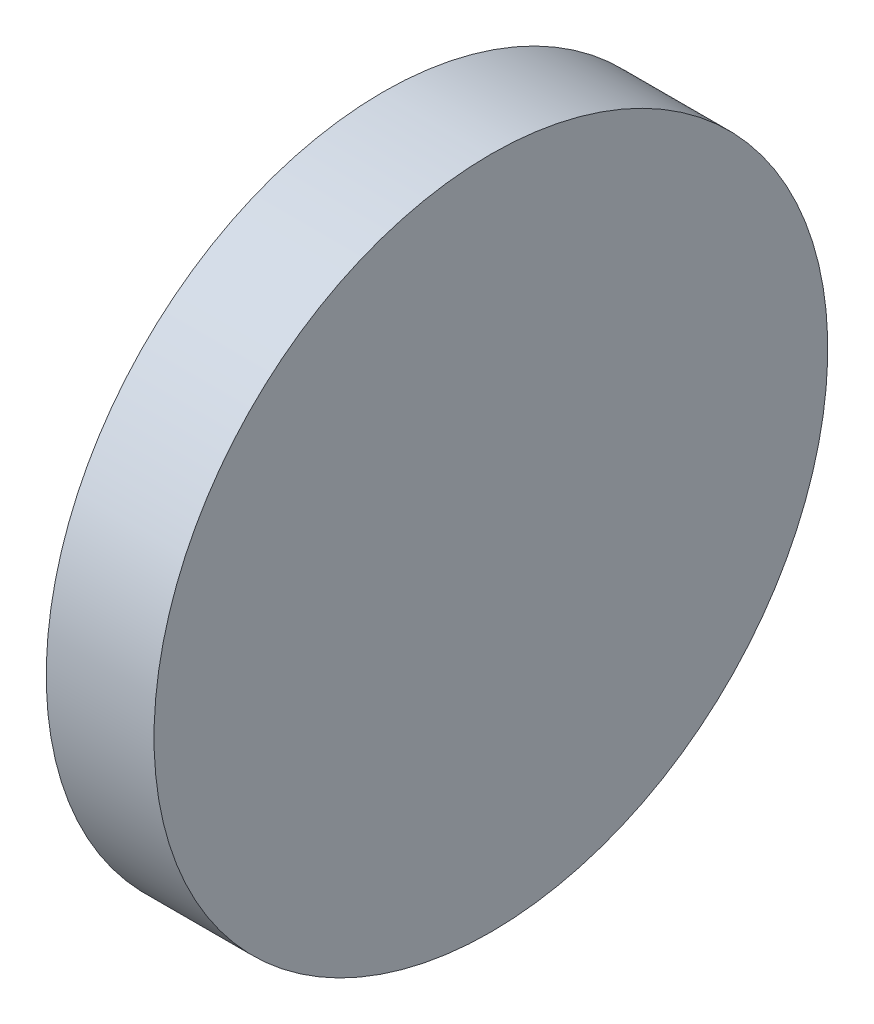
ISO-10303-21;
HEADER;
FILE_DESCRIPTION(('STEP AP214'),'2;1');
FILE_NAME('part.step','',(''),(''),'','','');
FILE_SCHEMA(('AUTOMOTIVE_DESIGN { 1 0 10303 214 1 1 1 1 }'));
ENDSEC;
DATA;
#1=APPLICATION_CONTEXT('core data for automotive mechanical design processes');
#2=APPLICATION_PROTOCOL_DEFINITION('international standard','automotive_design',2000,#1);
#3=PRODUCT_CONTEXT('',#1,'mechanical');
#4=PRODUCT('Part','Part','',(#3));
#5=PRODUCT_RELATED_PRODUCT_CATEGORY('part','',(#4));
#6=PRODUCT_DEFINITION_FORMATION('','',#4);
#7=PRODUCT_DEFINITION_CONTEXT('part definition',#1,'design');
#8=PRODUCT_DEFINITION('design','',#6,#7);
#9=PRODUCT_DEFINITION_SHAPE('','',#8);
#10=(LENGTH_UNIT() NAMED_UNIT(*) SI_UNIT(.MILLI.,.METRE.));
#11=(NAMED_UNIT(*) PLANE_ANGLE_UNIT() SI_UNIT($,.RADIAN.));
#12=(NAMED_UNIT(*) SI_UNIT($,.STERADIAN.) SOLID_ANGLE_UNIT());
#13=UNCERTAINTY_MEASURE_WITH_UNIT(LENGTH_MEASURE(1.E-05),#10,'distance_accuracy_value','');
#14=(GEOMETRIC_REPRESENTATION_CONTEXT(3) GLOBAL_UNCERTAINTY_ASSIGNED_CONTEXT((#13)) GLOBAL_UNIT_ASSIGNED_CONTEXT((#10,
#11,#12)) REPRESENTATION_CONTEXT('',''));
#15=CARTESIAN_POINT('',(0.,0.,0.));
#16=DIRECTION('',(0.,0.,1.));
#17=DIRECTION('',(1.,0.,0.));
#18=AXIS2_PLACEMENT_3D('',#15,#16,#17);
#19=CARTESIAN_POINT('',(0.384635714690617,-0.332340218761648,0.1012));
#20=DIRECTION('',(-1.,0.,0.));
#21=DIRECTION('',(0.,-1.,0.));
#22=AXIS2_PLACEMENT_3D('',#19,#20,#21);
#23=PLANE('',#22);
#24=CARTESIAN_POINT('',(0.384635714690617,-0.332340218761648,0.1012));
#25=DIRECTION('',(1.,0.,0.));
#26=DIRECTION('',(0.,1.,0.));
#27=AXIS2_PLACEMENT_3D('',#24,#25,#26);
#28=CIRCLE('',#27,0.03125);
#29=CARTESIAN_POINT('',(0.384635714690617,-0.301090218761648,0.1012));
#30=VERTEX_POINT('',#29);
#31=EDGE_CURVE('E18',#30,#30,#28,.F.);
#32=ORIENTED_EDGE('',*,*,#31,.F.);
#33=EDGE_LOOP('',(#32));
#34=FACE_BOUND('',#33,.T.);
#35=ADVANCED_FACE('F15',(#34),#23,.F.);
#36=CARTESIAN_POINT('',(0.404635714690617,-0.332340218761648,0.1012));
#37=DIRECTION('',(1.,0.,0.));
#38=DIRECTION('',(0.,1.,0.));
#39=AXIS2_PLACEMENT_3D('',#36,#37,#38);
#40=CYLINDRICAL_SURFACE('',#39,0.03125);
#41=CARTESIAN_POINT('',(0.374635714690617,-0.332340218761648,0.1012));
#42=DIRECTION('',(1.,0.,0.));
#43=DIRECTION('',(0.,1.,0.));
#44=AXIS2_PLACEMENT_3D('',#41,#42,#43);
#45=CIRCLE('',#44,0.03125);
#46=CARTESIAN_POINT('',(0.374635714690617,-0.301090218761648,0.1012));
#47=VERTEX_POINT('',#46);
#48=EDGE_CURVE('E10',#47,#47,#45,.T.);
#49=ORIENTED_EDGE('',*,*,#48,.T.);
#50=EDGE_LOOP('',(#49));
#51=FACE_BOUND('',#50,.T.);
#52=ORIENTED_EDGE('',*,*,#31,.T.);
#53=EDGE_LOOP('',(#52));
#54=FACE_BOUND('',#53,.T.);
#55=ADVANCED_FACE('F27',(#51,#54),#40,.T.);
#56=CARTESIAN_POINT('',(0.374635714690617,-0.332340218761648,0.1012));
#57=DIRECTION('',(1.,0.,0.));
#58=DIRECTION('',(0.,1.,0.));
#59=AXIS2_PLACEMENT_3D('',#56,#57,#58);
#60=PLANE('',#59);
#61=ORIENTED_EDGE('',*,*,#48,.F.);
#62=EDGE_LOOP('',(#61));
#63=FACE_BOUND('',#62,.T.);
#64=ADVANCED_FACE('F34',(#63),#60,.F.);
#65=CLOSED_SHELL('',(#35,#55,#64));
#66=MANIFOLD_SOLID_BREP('B1',#65);
#67=ADVANCED_BREP_SHAPE_REPRESENTATION('',(#18,#66),#14);
#68=SHAPE_DEFINITION_REPRESENTATION(#9,#67);
ENDSEC;
END-ISO-10303-21;
